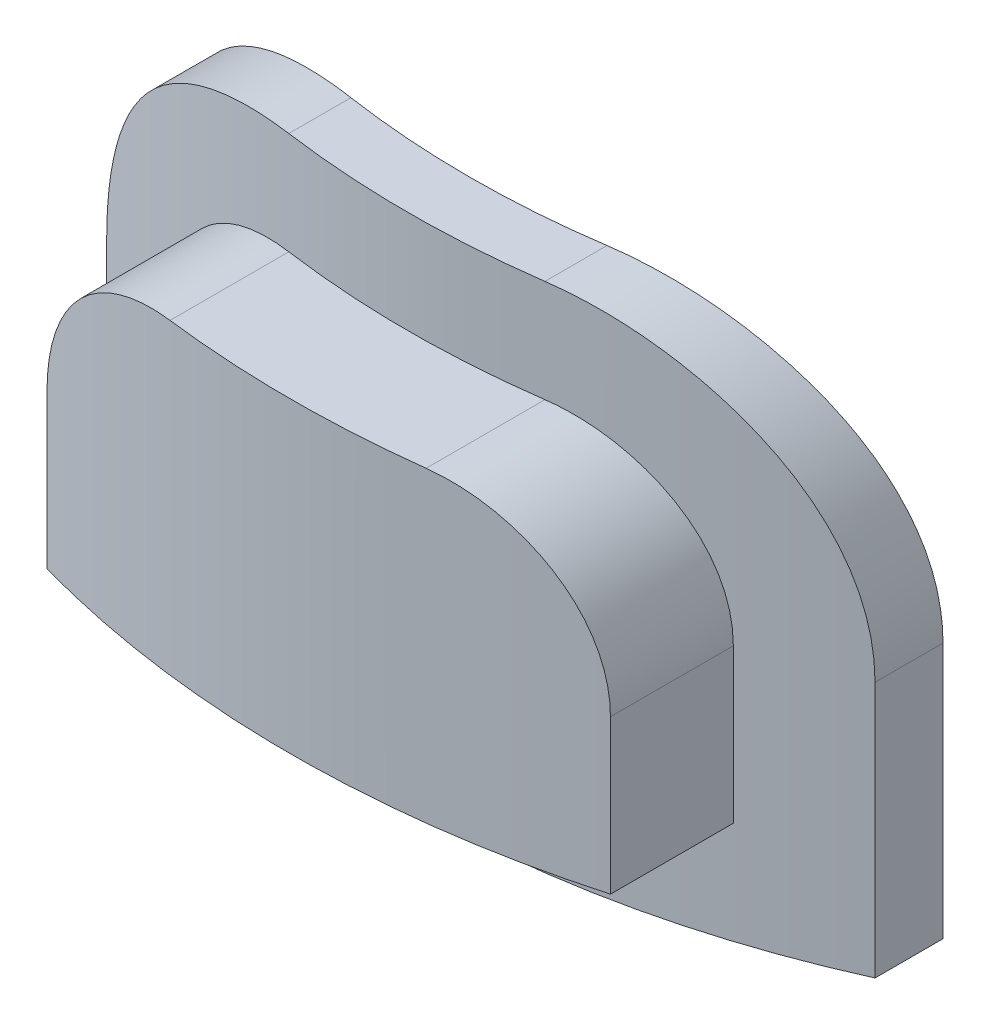
ISO-10303-21;
HEADER;
FILE_DESCRIPTION(('STEP AP214'),'2;1');
FILE_NAME('part.step','',(''),(''),'','','');
FILE_SCHEMA(('AUTOMOTIVE_DESIGN { 1 0 10303 214 1 1 1 1 }'));
ENDSEC;
DATA;
#1=APPLICATION_CONTEXT('core data for automotive mechanical design processes');
#2=APPLICATION_PROTOCOL_DEFINITION('international standard','automotive_design',2000,#1);
#3=PRODUCT_CONTEXT('',#1,'mechanical');
#4=PRODUCT('Part','Part','',(#3));
#5=PRODUCT_RELATED_PRODUCT_CATEGORY('part','',(#4));
#6=PRODUCT_DEFINITION_FORMATION('','',#4);
#7=PRODUCT_DEFINITION_CONTEXT('part definition',#1,'design');
#8=PRODUCT_DEFINITION('design','',#6,#7);
#9=PRODUCT_DEFINITION_SHAPE('','',#8);
#10=(LENGTH_UNIT() NAMED_UNIT(*) SI_UNIT(.MILLI.,.METRE.));
#11=(NAMED_UNIT(*) PLANE_ANGLE_UNIT() SI_UNIT($,.RADIAN.));
#12=(NAMED_UNIT(*) SI_UNIT($,.STERADIAN.) SOLID_ANGLE_UNIT());
#13=UNCERTAINTY_MEASURE_WITH_UNIT(LENGTH_MEASURE(1.E-05),#10,'distance_accuracy_value','');
#14=(GEOMETRIC_REPRESENTATION_CONTEXT(3) GLOBAL_UNCERTAINTY_ASSIGNED_CONTEXT((#13)) GLOBAL_UNIT_ASSIGNED_CONTEXT((#10,
#11,#12)) REPRESENTATION_CONTEXT('',''));
#15=CARTESIAN_POINT('',(0.,0.,0.));
#16=DIRECTION('',(0.,0.,1.));
#17=DIRECTION('',(1.,0.,0.));
#18=AXIS2_PLACEMENT_3D('',#15,#16,#17);
#19=CARTESIAN_POINT('',(0.,5.,0.));
#20=DIRECTION('',(0.,-1.,0.));
#21=DIRECTION('',(0.,0.,-1.));
#22=AXIS2_PLACEMENT_3D('',#19,#20,#21);
#23=CYLINDRICAL_SURFACE('',#22,8.5);
#24=DIRECTION('',(0.,-1.,0.));
#25=VECTOR('',#24,1.);
#26=CARTESIAN_POINT('',(-3.75,5.,7.62807315119618));
#27=LINE('',#26,#25);
#28=CARTESIAN_POINT('',(-3.75,0.,7.62807315119618));
#29=VERTEX_POINT('',#28);
#30=CARTESIAN_POINT('',(-3.75,2.5,7.62807315119618));
#31=VERTEX_POINT('',#30);
#32=EDGE_CURVE('E313',#29,#31,#27,.F.);
#33=ORIENTED_EDGE('',*,*,#32,.T.);
#34=CARTESIAN_POINT('',(-1.25,5.,8.40758586040012));
#35=CARTESIAN_POINT('',(-1.11527633630875,5.0000006675563,8.42761678228659));
#36=CARTESIAN_POINT('',(-0.980067726993901,4.98907881950588,8.44437922509842));
#37=CARTESIAN_POINT('',(-0.712559130804479,4.9453054998278,8.47114661131485));
#38=CARTESIAN_POINT('',(-0.580258873514958,4.9124560759831,8.48115218555762));
#39=CARTESIAN_POINT('',(-0.322493366822613,4.82556034376801,8.49486143334507));
#40=CARTESIAN_POINT('',(-0.197027388328415,4.77151630153589,8.49856578039391));
#41=CARTESIAN_POINT('',(0.0434727015224548,4.64370672720696,8.50074070468024));
#42=CARTESIAN_POINT('',(0.158505406936883,4.56993854244323,8.49921057761536));
#43=CARTESIAN_POINT('',(0.375526788148994,4.40430971028086,8.49239941522909));
#44=CARTESIAN_POINT('',(0.477443871551579,4.31235618280992,8.48709874536711));
#45=CARTESIAN_POINT('',(0.66483338824675,4.11310967805214,8.47448144847077));
#46=CARTESIAN_POINT('',(0.750303952831173,4.00581496005958,8.4671645925801));
#47=CARTESIAN_POINT('',(0.904396462982264,3.7759964917475,8.45211348962479));
#48=CARTESIAN_POINT('',(0.972566968867322,3.65317008622935,8.44437344657907));
#49=CARTESIAN_POINT('',(1.08743529986527,3.39777586849052,8.43035294157353));
#50=CARTESIAN_POINT('',(1.13413309697848,3.26520804356761,8.42407248151697));
#51=CARTESIAN_POINT('',(1.20482622415403,2.99355043280274,8.41425491186282));
#52=CARTESIAN_POINT('',(1.22874219154639,2.85443960643935,8.41072740007635));
#53=CARTESIAN_POINT('',(1.25285608166608,2.57413785983828,8.40716991411397));
#54=CARTESIAN_POINT('',(1.25305560103829,2.43294708026779,8.40713970449176));
#55=CARTESIAN_POINT('',(1.22985510780667,2.15401193834105,8.41056390144703));
#56=CARTESIAN_POINT('',(1.2066943287525,2.01624714761094,8.41398298379495));
#57=CARTESIAN_POINT('',(1.13782686364863,1.74657282641444,8.42357088878668));
#58=CARTESIAN_POINT('',(1.09211891049656,1.61466362547369,8.42973986596675));
#59=CARTESIAN_POINT('',(0.979247569768038,1.35984660550828,8.44359533540404));
#60=CARTESIAN_POINT('',(0.912001819869463,1.23697560424031,8.45128760905227));
#61=CARTESIAN_POINT('',(0.757959921476296,1.00414435560503,8.46649084407854));
#62=CARTESIAN_POINT('',(0.67116228631113,0.894185090977744,8.47400179162094));
#63=CARTESIAN_POINT('',(0.479573594588255,0.689365171798441,8.48700664516004));
#64=CARTESIAN_POINT('',(0.374639866670625,0.594636701022906,8.49248338211674));
#65=CARTESIAN_POINT('',(0.150237260666964,0.424142585904,8.49941186296481));
#66=CARTESIAN_POINT('',(0.030770268844126,0.348374484600208,8.5008641286092));
#67=CARTESIAN_POINT('',(-0.217333908493297,0.219017192052513,8.49811224994414));
#68=CARTESIAN_POINT('',(-0.345810130460131,0.165117799328062,8.49399109418641));
#69=CARTESIAN_POINT('',(-0.609565017242179,0.0794501416514689,8.47914233315239));
#70=CARTESIAN_POINT('',(-0.744842465038015,0.0476779322408202,8.46841590599442));
#71=CARTESIAN_POINT('',(-1.01506885962729,0.00739764887891314,8.4402422574371));
#72=CARTESIAN_POINT('',(-1.14996089360887,-0.00160163790743167,8.42294636908654));
#73=CARTESIAN_POINT('',(-1.41844778814057,0.00206963442643112,8.38191235820854));
#74=CARTESIAN_POINT('',(-1.55204255934868,0.0147416755468378,8.35817379519028));
#75=CARTESIAN_POINT('',(-1.81632932140585,0.061242263397403,8.30478137153844));
#76=CARTESIAN_POINT('',(-1.946950928167,0.0953755450744826,8.27504657176548));
#77=CARTESIAN_POINT('',(-2.20012909232565,0.18370003126403,8.21136381122794));
#78=CARTESIAN_POINT('',(-2.3226834777036,0.237896611815497,8.17741472285042));
#79=CARTESIAN_POINT('',(-2.56343285395966,0.368187062496278,8.10527274068938));
#80=CARTESIAN_POINT('',(-2.6810343141059,0.445306037022554,8.06694965225901));
#81=CARTESIAN_POINT('',(-2.90172237874028,0.618120429739,7.9902240631891));
#82=CARTESIAN_POINT('',(-3.00480301353537,0.713823449829269,7.95182153643648));
#83=CARTESIAN_POINT('',(-3.1975140978759,0.925689139261734,7.8763583260915));
#84=CARTESIAN_POINT('',(-3.28649003745961,1.04248769599738,7.83940299693696));
#85=CARTESIAN_POINT('',(-3.44325901546629,1.2911996884414,7.771826220011));
#86=CARTESIAN_POINT('',(-3.51105916392675,1.42310803047428,7.74120264744268));
#87=CARTESIAN_POINT('',(-3.62014114156516,1.69220879758193,7.69077673586528));
#88=CARTESIAN_POINT('',(-3.66249476048576,1.82888296768165,7.67054323039584));
#89=CARTESIAN_POINT('',(-3.72329966959897,2.10856686614807,7.64121828064005));
#90=CARTESIAN_POINT('',(-3.74177133917026,2.25157108490913,7.63211733687186));
#91=CARTESIAN_POINT('',(-3.75326327270084,2.52524876770563,7.62646912612301));
#92=CARTESIAN_POINT('',(-3.74852353818925,2.65581055825829,7.62881690889369));
#93=CARTESIAN_POINT('',(-3.71889534520874,2.91405752920416,7.64330328511075));
#94=CARTESIAN_POINT('',(-3.69400747645747,3.04174279367825,7.65544159199731));
#95=CARTESIAN_POINT('',(-3.62593698592528,3.28797238865289,7.68790924095043));
#96=CARTESIAN_POINT('',(-3.58316045835813,3.40665446229439,7.70805630123149));
#97=CARTESIAN_POINT('',(-3.48091283816763,3.63521599155453,7.7547658364077));
#98=CARTESIAN_POINT('',(-3.42143722591223,3.74509305372065,7.78133004784219));
#99=CARTESIAN_POINT('',(-3.28240454351572,3.96189837055597,7.84104280541274));
#100=CARTESIAN_POINT('',(-3.20166837603727,4.06797418348805,7.87453750314042));
#101=CARTESIAN_POINT('',(-3.02491780473161,4.26557579392537,7.94411049632042));
#102=CARTESIAN_POINT('',(-2.9288960284365,4.35709452754147,7.98019003383625));
#103=CARTESIAN_POINT('',(-2.71509427055919,4.5307640821006,8.05556538118288));
#104=CARTESIAN_POINT('',(-2.59616879442661,4.61150241344252,8.09487908298208));
#105=CARTESIAN_POINT('',(-2.34563176565117,4.75170856314094,8.17099338750652));
#106=CARTESIAN_POINT('',(-2.21402077490426,4.81117732306902,8.20779410141955));
#107=CARTESIAN_POINT('',(-1.94610216424461,4.90517903242794,8.27533064467517));
#108=CARTESIAN_POINT('',(-1.81011559926145,4.94050506239353,8.30623251518836));
#109=CARTESIAN_POINT('',(-1.5329299970716,4.98790991023623,8.36182214548129));
#110=CARTESIAN_POINT('',(-1.39173335956116,4.99999929771062,8.38651272613186));
#111=CARTESIAN_POINT('',(-1.25,5.,8.40758586040012));
#112=B_SPLINE_CURVE_WITH_KNOTS('',3,(#34,#35,#36,#37,#38,#39,#40,#41,#42,#43,#44,#45,#46,#47,
#48,#49,#50,#51,#52,#53,#54,#55,#56,#57,#58,#59,#60,#61,#62,#63,#64,#65,#66,#67,#68,#69,#70,#71,
#72,#73,#74,#75,#76,#77,#78,#79,#80,#81,#82,#83,#84,#85,#86,#87,#88,#89,#90,#91,#92,#93,#94,#95,
#96,#97,#98,#99,#100,#101,#102,#103,#104,#105,#106,#107,#108,#109,#110,#111),.UNSPECIFIED.,.T.,
.F.,(4,2,2,2,2,2,2,2,2,2,2,2,2,2,2,2,2,2,2,2,2,2,2,2,2,2,2,2,2,2,2,2,2,2,2,2,2,2,4),(0.,
0.408120216394532,0.816202324394259,1.22424081195945,1.63233420356413,2.04256838598693,
2.45284915309353,2.8729343771028,3.29302014888754,3.71456403472322,4.13607954125567,
4.5533216878384,4.97058728519829,5.38946798426441,5.80838054460301,6.23075250542988,
6.6530697052352,7.06916732105481,7.48519074305774,7.89216093809074,8.29915896501436,
8.7120707956948,9.12509334788576,9.56043683136778,9.99595877092002,10.4479189790577,
10.8997272723412,11.3308545134453,11.7616136138744,12.1516698959668,12.5417147618777,
12.9233484355043,13.3050854985832,13.71571162798,14.1265364116648,14.5715345450817,
15.0165129766695,15.4460631943471,15.875417977238),.UNSPECIFIED.);
#113=CARTESIAN_POINT('',(-1.25,5.,8.40758586040012));
#114=VERTEX_POINT('',#113);
#115=EDGE_CURVE('E308',#31,#114,#112,.T.);
#116=ORIENTED_EDGE('',*,*,#115,.T.);
#117=CARTESIAN_POINT('',(0.,5.,0.));
#118=DIRECTION('',(0.,1.,0.));
#119=DIRECTION('',(0.,0.,1.));
#120=AXIS2_PLACEMENT_3D('',#117,#118,#119);
#121=CIRCLE('',#120,8.5);
#122=CARTESIAN_POINT('',(1.25,5.,8.40758586040012));
#123=VERTEX_POINT('',#122);
#124=EDGE_CURVE('E341',#114,#123,#121,.T.);
#125=ORIENTED_EDGE('',*,*,#124,.T.);
#126=CARTESIAN_POINT('',(1.25,5.,8.40758586040012));
#127=CARTESIAN_POINT('',(1.32109498409677,5.0000078043449,8.397024564467));
#128=CARTESIAN_POINT('',(1.39204227683481,4.99696760173464,8.38554623136623));
#129=CARTESIAN_POINT('',(1.53310748251208,4.98492437728934,8.36090112066793));
#130=CARTESIAN_POINT('',(1.60322568911255,4.97592353527694,8.34773496173197));
#131=CARTESIAN_POINT('',(1.74194811862711,4.95212691793934,8.31989270968634));
#132=CARTESIAN_POINT('',(1.81055617228141,4.93734818168633,8.30522114900417));
#133=CARTESIAN_POINT('',(1.94599670313446,4.90218432385241,8.2745348955105));
#134=CARTESIAN_POINT('',(2.01282905335053,4.88179880250055,8.25852010698175));
#135=CARTESIAN_POINT('',(2.20987826013263,4.81256726064929,8.2088184502288));
#136=CARTESIAN_POINT('',(2.33691398060633,4.75559967071488,8.17341983953064));
#137=CARTESIAN_POINT('',(2.57931012291404,4.62182664632304,8.10020116817731));
#138=CARTESIAN_POINT('',(2.69466136400265,4.545005778455,8.06237924098058));
#139=CARTESIAN_POINT('',(2.91563592547765,4.36984826471379,7.98519334402301));
#140=CARTESIAN_POINT('',(3.02066213603807,4.27075515897463,7.94583008496088));
#141=CARTESIAN_POINT('',(3.21262713455137,4.05528621504434,7.870177783025));
#142=CARTESIAN_POINT('',(3.29956220570281,3.93890683381021,7.83388937278106));
#143=CARTESIAN_POINT('',(3.45257191055821,3.69155994264599,7.76767096131929));
#144=CARTESIAN_POINT('',(3.51865692848634,3.56059973870235,7.73773779735249));
#145=CARTESIAN_POINT('',(3.62720528824781,3.28763308795972,7.68745759818812));
#146=CARTESIAN_POINT('',(3.66971445829755,3.1456486878365,7.66709197687445));
#147=CARTESIAN_POINT('',(3.71614939701319,2.91850850837562,7.64464325473185));
#148=CARTESIAN_POINT('',(3.72881394055898,2.83545002134511,7.63846137081106));
#149=CARTESIAN_POINT('',(3.74574676163379,2.66828187225346,7.63016470710817));
#150=CARTESIAN_POINT('',(3.75001489677904,2.58417219239083,7.62804999629597));
#151=CARTESIAN_POINT('',(3.75,2.5,7.62807315119618));
#152=B_SPLINE_CURVE_WITH_KNOTS('',3,(#126,#127,#128,#129,#130,#131,#132,#133,#134,#135,#136,
#137,#138,#139,#140,#141,#142,#143,#144,#145,#146,#147,#148,#149,#150,#151),.UNSPECIFIED.,.F.,
.F.,(4,2,2,2,2,2,2,2,2,2,2,2,4),(0.,0.215537630848035,0.430996482472698,0.645824679066829,
0.860668197158763,1.28953695550444,1.71874011315056,2.16563799169668,2.61262759439177,
3.0593942243094,3.5052893297048,3.75754987330671,4.00981469463004),.UNSPECIFIED.);
#153=CARTESIAN_POINT('',(3.75,2.5,7.62807315119618));
#154=VERTEX_POINT('',#153);
#155=EDGE_CURVE('E301',#123,#154,#152,.T.);
#156=ORIENTED_EDGE('',*,*,#155,.T.);
#157=DIRECTION('',(0.,-1.,0.));
#158=VECTOR('',#157,1.);
#159=CARTESIAN_POINT('',(3.75,5.,7.62807315119618));
#160=LINE('',#159,#158);
#161=CARTESIAN_POINT('',(3.75,0.,7.62807315119618));
#162=VERTEX_POINT('',#161);
#163=EDGE_CURVE('E332',#162,#154,#160,.F.);
#164=ORIENTED_EDGE('',*,*,#163,.F.);
#165=CARTESIAN_POINT('',(0.,0.,0.));
#166=DIRECTION('',(0.,1.,0.));
#167=DIRECTION('',(0.,0.,1.));
#168=AXIS2_PLACEMENT_3D('',#165,#166,#167);
#169=CIRCLE('',#168,8.5);
#170=EDGE_CURVE('E344',#29,#162,#169,.T.);
#171=ORIENTED_EDGE('',*,*,#170,.F.);
#172=EDGE_LOOP('',(#33,#116,#125,#156,#164,#171));
#173=FACE_BOUND('',#172,.T.);
#174=CARTESIAN_POINT('',(0.,1.5,0.));
#175=DIRECTION('',(0.,1.,0.));
#176=DIRECTION('',(-1.,0.,0.));
#177=AXIS2_PLACEMENT_3D('',#174,#175,#176);
#178=CIRCLE('',#177,8.5);
#179=CARTESIAN_POINT('',(-1.5,1.5,8.36660026534076));
#180=VERTEX_POINT('',#179);
#181=CARTESIAN_POINT('',(1.5,1.5,8.36660026534076));
#182=VERTEX_POINT('',#181);
#183=EDGE_CURVE('E262',#180,#182,#178,.T.);
#184=ORIENTED_EDGE('',*,*,#183,.T.);
#185=DIRECTION('',(0.,-1.,0.));
#186=VECTOR('',#185,1.);
#187=CARTESIAN_POINT('',(1.5,5.,8.36660026534076));
#188=LINE('',#187,#186);
#189=CARTESIAN_POINT('',(1.5,3.3,8.36660026534076));
#190=VERTEX_POINT('',#189);
#191=EDGE_CURVE('E12',#182,#190,#188,.F.);
#192=ORIENTED_EDGE('',*,*,#191,.T.);
#193=CARTESIAN_POINT('',(0.,3.3,0.));
#194=DIRECTION('',(0.,-1.,0.));
#195=DIRECTION('',(1.,0.,0.));
#196=AXIS2_PLACEMENT_3D('',#193,#194,#195);
#197=CIRCLE('',#196,8.5);
#198=CARTESIAN_POINT('',(-1.5,3.3,8.36660026534076));
#199=VERTEX_POINT('',#198);
#200=EDGE_CURVE('E44',#190,#199,#197,.T.);
#201=ORIENTED_EDGE('',*,*,#200,.T.);
#202=DIRECTION('',(0.,-1.,0.));
#203=VECTOR('',#202,1.);
#204=CARTESIAN_POINT('',(-1.5,5.,8.36660026534076));
#205=LINE('',#204,#203);
#206=EDGE_CURVE('E543',#199,#180,#205,.T.);
#207=ORIENTED_EDGE('',*,*,#206,.T.);
#208=EDGE_LOOP('',(#184,#192,#201,#207));
#209=FACE_BOUND('',#208,.T.);
#210=ADVANCED_FACE('F35',(#173,#209),#23,.F.);
#211=CARTESIAN_POINT('',(0.,0.,0.));
#212=DIRECTION('',(0.,1.,0.));
#213=DIRECTION('',(0.,0.,1.));
#214=AXIS2_PLACEMENT_3D('',#211,#212,#213);
#215=PLANE('',#214);
#216=DIRECTION('',(0.,0.,1.));
#217=VECTOR('',#216,1.);
#218=CARTESIAN_POINT('',(3.75,0.,-10.25));
#219=LINE('',#218,#217);
#220=CARTESIAN_POINT('',(3.75,0.,8.29141121884568));
#221=VERTEX_POINT('',#220);
#222=EDGE_CURVE('E335',#162,#221,#219,.T.);
#223=ORIENTED_EDGE('',*,*,#222,.T.);
#224=CARTESIAN_POINT('',(0.,0.,0.));
#225=DIRECTION('',(0.,-1.,0.));
#226=DIRECTION('',(0.,0.,-1.));
#227=AXIS2_PLACEMENT_3D('',#224,#225,#226);
#228=CIRCLE('',#227,9.1);
#229=CARTESIAN_POINT('',(-3.75,0.,8.29141121884568));
#230=VERTEX_POINT('',#229);
#231=EDGE_CURVE('E170',#230,#221,#228,.F.);
#232=ORIENTED_EDGE('',*,*,#231,.F.);
#233=DIRECTION('',(0.,0.,1.));
#234=VECTOR('',#233,1.);
#235=CARTESIAN_POINT('',(-3.75,0.,-10.25));
#236=LINE('',#235,#234);
#237=EDGE_CURVE('E354',#29,#230,#236,.T.);
#238=ORIENTED_EDGE('',*,*,#237,.F.);
#239=ORIENTED_EDGE('',*,*,#170,.T.);
#240=EDGE_LOOP('',(#223,#232,#238,#239));
#241=FACE_BOUND('',#240,.T.);
#242=ADVANCED_FACE('F283',(#241),#215,.F.);
#243=CARTESIAN_POINT('',(0.,5.,0.));
#244=DIRECTION('',(0.,1.,0.));
#245=DIRECTION('',(0.,0.,1.));
#246=AXIS2_PLACEMENT_3D('',#243,#244,#245);
#247=PLANE('',#246);
#248=CARTESIAN_POINT('',(0.,5.,0.));
#249=DIRECTION('',(0.,-1.,0.));
#250=DIRECTION('',(0.,0.,-1.));
#251=AXIS2_PLACEMENT_3D('',#248,#249,#250);
#252=CIRCLE('',#251,9.1);
#253=CARTESIAN_POINT('',(-1.25,5.,9.01373951254417));
#254=VERTEX_POINT('',#253);
#255=CARTESIAN_POINT('',(1.25,5.,9.01373951254417));
#256=VERTEX_POINT('',#255);
#257=EDGE_CURVE('E226',#254,#256,#252,.F.);
#258=ORIENTED_EDGE('',*,*,#257,.T.);
#259=DIRECTION('',(0.,0.,1.));
#260=VECTOR('',#259,1.);
#261=CARTESIAN_POINT('',(1.25,5.,-10.25));
#262=LINE('',#261,#260);
#263=EDGE_CURVE('E337',#123,#256,#262,.T.);
#264=ORIENTED_EDGE('',*,*,#263,.F.);
#265=ORIENTED_EDGE('',*,*,#124,.F.);
#266=DIRECTION('',(0.,0.,1.));
#267=VECTOR('',#266,1.);
#268=CARTESIAN_POINT('',(-1.25,5.,-10.25));
#269=LINE('',#268,#267);
#270=EDGE_CURVE('E357',#114,#254,#269,.T.);
#271=ORIENTED_EDGE('',*,*,#270,.T.);
#272=EDGE_LOOP('',(#258,#264,#265,#271));
#273=FACE_BOUND('',#272,.T.);
#274=ADVANCED_FACE('F289',(#273),#247,.T.);
#275=CARTESIAN_POINT('',(3.75,0.,-10.25));
#276=DIRECTION('',(-1.,0.,0.));
#277=DIRECTION('',(0.,-1.,0.));
#278=AXIS2_PLACEMENT_3D('',#275,#276,#277);
#279=PLANE('',#278);
#280=DIRECTION('',(0.,0.,1.));
#281=VECTOR('',#280,1.);
#282=CARTESIAN_POINT('',(3.75,2.5,-10.25));
#283=LINE('',#282,#281);
#284=CARTESIAN_POINT('',(3.75,2.5,8.29141121884568));
#285=VERTEX_POINT('',#284);
#286=EDGE_CURVE('E222',#154,#285,#283,.T.);
#287=ORIENTED_EDGE('',*,*,#286,.T.);
#288=DIRECTION('',(0.,-1.,0.));
#289=VECTOR('',#288,1.);
#290=CARTESIAN_POINT('',(3.75,5.,8.29141121884568));
#291=LINE('',#290,#289);
#292=EDGE_CURVE('E329',#285,#221,#291,.T.);
#293=ORIENTED_EDGE('',*,*,#292,.T.);
#294=ORIENTED_EDGE('',*,*,#222,.F.);
#295=ORIENTED_EDGE('',*,*,#163,.T.);
#296=EDGE_LOOP('',(#287,#293,#294,#295));
#297=FACE_BOUND('',#296,.T.);
#298=ADVANCED_FACE('F317',(#297),#279,.F.);
#299=CARTESIAN_POINT('',(1.25,2.5,-10.25));
#300=DIRECTION('',(0.,0.,1.));
#301=DIRECTION('',(1.,0.,0.));
#302=AXIS2_PLACEMENT_3D('',#299,#300,#301);
#303=CYLINDRICAL_SURFACE('',#302,2.5);
#304=CARTESIAN_POINT('',(3.75,2.5,8.29141121884568));
#305=CARTESIAN_POINT('',(3.75001002585667,2.56668328002895,8.29140028132558));
#306=CARTESIAN_POINT('',(3.74733226391829,2.63335963596565,8.29261761935478));
#307=CARTESIAN_POINT('',(3.73667905745048,2.76617904564726,8.29742682159189));
#308=CARTESIAN_POINT('',(3.72870545351762,2.83232227660139,8.30101786080594));
#309=CARTESIAN_POINT('',(3.70757960177401,2.96334719349341,8.31047408412195));
#310=CARTESIAN_POINT('',(3.69444765669241,3.02823279124661,8.31633035114265));
#311=CARTESIAN_POINT('',(3.6631574010249,3.15653431830028,8.33016020450381));
#312=CARTESIAN_POINT('',(3.64499883103864,3.2199501715711,8.33813390011388));
#313=CARTESIAN_POINT('',(3.58327295763412,3.40722895021895,8.36493795981294));
#314=CARTESIAN_POINT('',(3.53241582628127,3.52836510849129,8.38666981404831));
#315=CARTESIAN_POINT('',(3.41303636201255,3.76029277800592,8.43595465002086));
#316=CARTESIAN_POINT('',(3.34449885498615,3.87107529146149,8.46351262832077));
#317=CARTESIAN_POINT('',(3.18784753257445,4.08531157286444,8.5237904525393));
#318=CARTESIAN_POINT('',(3.09892646983261,4.18812227169586,8.55669945447047));
#319=CARTESIAN_POINT('',(2.90595457400091,4.37780101411043,8.62414463720136));
#320=CARTESIAN_POINT('',(2.80189784049669,4.46466281023979,8.65868144901273));
#321=CARTESIAN_POINT('',(2.57381390647128,4.62561316810556,8.72929647312018));
#322=CARTESIAN_POINT('',(2.44893023067962,4.69851177551892,8.76532985021694));
#323=CARTESIAN_POINT('',(2.18779151322515,4.82193291913908,8.8341250155944));
#324=CARTESIAN_POINT('',(2.05154573985379,4.87247348511016,8.86688942343183));
#325=CARTESIAN_POINT('',(1.80448592216433,4.9402554030829,8.91996484884727));
#326=CARTESIAN_POINT('',(1.69527364977672,4.96254416978487,8.94138883027841));
#327=CARTESIAN_POINT('',(1.47417384222457,4.99243717311587,8.98051404728974));
#328=CARTESIAN_POINT('',(1.36228540078739,5.00003636181393,8.99821400128267));
#329=CARTESIAN_POINT('',(1.25,5.,9.01373951254417));
#330=B_SPLINE_CURVE_WITH_KNOTS('',3,(#304,#305,#306,#307,#308,#309,#310,#311,#312,#313,#314,
#315,#316,#317,#318,#319,#320,#321,#322,#323,#324,#325,#326,#327,#328,#329),.UNSPECIFIED.,.F.,
.F.,(4,2,2,2,2,2,2,2,2,2,2,2,4),(0.,0.19997341207444,0.399877358726516,0.599002262078049,
0.798137443240494,1.19567928559974,1.59356345837899,2.01133482591711,2.42926949402788,
2.87424305162385,3.3188571207313,3.65836735401477,3.99799423597027),.UNSPECIFIED.);
#331=EDGE_CURVE('E167',#285,#256,#330,.T.);
#332=ORIENTED_EDGE('',*,*,#331,.F.);
#333=ORIENTED_EDGE('',*,*,#286,.F.);
#334=ORIENTED_EDGE('',*,*,#155,.F.);
#335=ORIENTED_EDGE('',*,*,#263,.T.);
#336=EDGE_LOOP('',(#332,#333,#334,#335));
#337=FACE_BOUND('',#336,.T.);
#338=ADVANCED_FACE('F296',(#337),#303,.T.);
#339=CARTESIAN_POINT('',(-3.75,0.,-10.25));
#340=DIRECTION('',(-1.,0.,0.));
#341=DIRECTION('',(0.,-1.,0.));
#342=AXIS2_PLACEMENT_3D('',#339,#340,#341);
#343=PLANE('',#342);
#344=DIRECTION('',(0.,-1.,0.));
#345=VECTOR('',#344,1.);
#346=CARTESIAN_POINT('',(-3.75,5.,8.29141121884568));
#347=LINE('',#346,#345);
#348=CARTESIAN_POINT('',(-3.75,2.5,8.29141121884568));
#349=VERTEX_POINT('',#348);
#350=EDGE_CURVE('E189',#349,#230,#347,.T.);
#351=ORIENTED_EDGE('',*,*,#350,.F.);
#352=DIRECTION('',(0.,0.,1.));
#353=VECTOR('',#352,1.);
#354=CARTESIAN_POINT('',(-3.75,2.5,-10.25));
#355=LINE('',#354,#353);
#356=EDGE_CURVE('E346',#31,#349,#355,.T.);
#357=ORIENTED_EDGE('',*,*,#356,.F.);
#358=ORIENTED_EDGE('',*,*,#32,.F.);
#359=ORIENTED_EDGE('',*,*,#237,.T.);
#360=EDGE_LOOP('',(#351,#357,#358,#359));
#361=FACE_BOUND('',#360,.T.);
#362=ADVANCED_FACE('F201',(#361),#343,.T.);
#363=CARTESIAN_POINT('',(-1.25,2.5,-10.25));
#364=DIRECTION('',(0.,0.,1.));
#365=DIRECTION('',(1.,0.,0.));
#366=AXIS2_PLACEMENT_3D('',#363,#364,#365);
#367=CYLINDRICAL_SURFACE('',#366,2.5);
#368=CARTESIAN_POINT('',(-1.25,5.,9.01373951254417));
#369=CARTESIAN_POINT('',(-1.32101124740736,5.00000767112239,9.00390003664837));
#370=CARTESIAN_POINT('',(-1.3918938567813,4.99697470601398,8.99320700751757));
#371=CARTESIAN_POINT('',(-1.53287235118059,4.98494998991493,8.97024874727763));
#372=CARTESIAN_POINT('',(-1.60296848451393,4.97596017673178,8.95798402849718));
#373=CARTESIAN_POINT('',(-1.74170768195296,4.95217559681137,8.93204507532227));
#374=CARTESIAN_POINT('',(-1.81035409915526,4.93739624773325,8.91837465506818));
#375=CARTESIAN_POINT('',(-1.94590676296099,4.9022120677279,8.88978370948395));
#376=CARTESIAN_POINT('',(-2.01281290358917,4.88180689508614,8.87486310825571));
#377=CARTESIAN_POINT('',(-2.21015274608582,4.81246600011729,8.82855563638446));
#378=CARTESIAN_POINT('',(-2.33744865323303,4.75536293501446,8.79557730294177));
#379=CARTESIAN_POINT('',(-2.58037489087526,4.621180149911,8.72740793693066));
#380=CARTESIAN_POINT('',(-2.69599742080382,4.54408719311157,8.69221544994507));
#381=CARTESIAN_POINT('',(-2.91682573414429,4.36875772402363,8.6206766294969));
#382=CARTESIAN_POINT('',(-3.02151499446997,4.26986691826992,8.58433375920132));
#383=CARTESIAN_POINT('',(-3.21283716249547,4.05498104327679,8.51458004233961));
#384=CARTESIAN_POINT('',(-3.29946692963101,3.93898300505083,8.48116970632808));
#385=CARTESIAN_POINT('',(-3.45185518588814,3.69279592007848,8.42029915436359));
#386=CARTESIAN_POINT('',(-3.51764360175908,3.56262758536556,8.39283042482878));
#387=CARTESIAN_POINT('',(-3.6258433677077,3.29156469375932,8.34666161548046));
#388=CARTESIAN_POINT('',(-3.66829459326271,3.15068890424058,8.32794658672668));
#389=CARTESIAN_POINT('',(-3.71529798732226,2.9237128395815,8.30703955845716));
#390=CARTESIAN_POINT('',(-3.72828435953488,2.83960642196457,8.30120744723347));
#391=CARTESIAN_POINT('',(-3.74564177537422,2.6703531836863,8.29338288079254));
#392=CARTESIAN_POINT('',(-3.75001465936463,2.58520658918267,8.29138960536909));
#393=CARTESIAN_POINT('',(-3.75,2.5,8.29141121884568));
#394=B_SPLINE_CURVE_WITH_KNOTS('',3,(#368,#369,#370,#371,#372,#373,#374,#375,#376,#377,#378,
#379,#380,#381,#382,#383,#384,#385,#386,#387,#388,#389,#390,#391,#392,#393),.UNSPECIFIED.,.F.,
.F.,(4,2,2,2,2,2,2,2,2,2,2,2,4),(0.,0.214983749604198,0.429897597689074,0.644242974261521,
0.858601373118001,1.28658140123102,1.71484555381219,2.15833642039304,2.60190434627071,
3.04483242131611,3.48700130884952,3.74242746538431,3.99779904147261),.UNSPECIFIED.);
#395=EDGE_CURVE('E181',#254,#349,#394,.T.);
#396=ORIENTED_EDGE('',*,*,#395,.F.);
#397=ORIENTED_EDGE('',*,*,#270,.F.);
#398=ORIENTED_EDGE('',*,*,#115,.F.);
#399=ORIENTED_EDGE('',*,*,#356,.T.);
#400=EDGE_LOOP('',(#396,#397,#398,#399));
#401=FACE_BOUND('',#400,.T.);
#402=ADVANCED_FACE('F269',(#401),#367,.T.);
#403=CARTESIAN_POINT('',(-1.25,2.5,6.26057374902612));
#404=DIRECTION('',(0.,0.,1.));
#405=DIRECTION('',(1.,0.,0.));
#406=AXIS2_PLACEMENT_3D('',#403,#404,#405);
#407=CYLINDRICAL_SURFACE('',#406,1.5);
#408=CARTESIAN_POINT('',(-2.75,2.5,9.87420882906575));
#409=CARTESIAN_POINT('',(-2.7500005767303,2.54125651897526,9.87420712417281));
#410=CARTESIAN_POINT('',(-2.74829679088054,2.5824926549046,9.87468334290739));
#411=CARTESIAN_POINT('',(-2.74150536298313,2.66465725992845,9.87657161255729));
#412=CARTESIAN_POINT('',(-2.73641825667773,2.70558577669634,9.87798351530873));
#413=CARTESIAN_POINT('',(-2.7161581332523,2.82729083830642,9.88358199720229));
#414=CARTESIAN_POINT('',(-2.69598596866482,2.90723195012714,9.88913158962226));
#415=CARTESIAN_POINT('',(-2.6429833586683,3.06243456856704,9.90342778309972));
#416=CARTESIAN_POINT('',(-2.61015347265053,3.1376962818154,9.91217424287501));
#417=CARTESIAN_POINT('',(-2.53285585488331,3.28163514312502,9.93220670121541));
#418=CARTESIAN_POINT('',(-2.48838525314867,3.35031066166554,9.94349332595458));
#419=CARTESIAN_POINT('',(-2.3880760031691,3.48065484467193,9.96806428225641));
#420=CARTESIAN_POINT('',(-2.33202534197718,3.54215341229658,9.98138444652483));
#421=CARTESIAN_POINT('',(-2.21066418289851,3.65498552408141,10.0089625210196));
#422=CARTESIAN_POINT('',(-2.14535101630446,3.70631612840264,10.0232207008695));
#423=CARTESIAN_POINT('',(-2.00521691778894,3.79880483000746,10.0522068023356));
#424=CARTESIAN_POINT('',(-1.9301793916387,3.83963431054933,10.0669366080802));
#425=CARTESIAN_POINT('',(-1.77416223307095,3.90801218429246,10.0955992731535));
#426=CARTESIAN_POINT('',(-1.69318613808403,3.93556841111917,10.1095325982599));
#427=CARTESIAN_POINT('',(-1.55158986132622,3.97061759945708,10.1320587193628));
#428=CARTESIAN_POINT('',(-1.49187291091381,3.98161086977195,10.1410288513174));
#429=CARTESIAN_POINT('',(-1.37147080359788,3.99630473255609,10.1580170053937));
#430=CARTESIAN_POINT('',(-1.31078654094939,4.00001170687878,10.1660358549252));
#431=CARTESIAN_POINT('',(-1.25,4.,10.1734949746879));
#432=B_SPLINE_CURVE_WITH_KNOTS('',3,(#408,#409,#410,#411,#412,#413,#414,#415,#416,#417,#418,
#419,#420,#421,#422,#423,#424,#425,#426,#427,#428,#429,#430,#431),.UNSPECIFIED.,.F.,.F.,(4,2,2,
2,2,2,2,2,2,2,2,4),(0.,0.123691505002667,0.247363428356568,0.493981698841425,0.74058907160692,
0.987257302075676,1.23892174333978,1.49065884187746,1.74951287383133,2.00821394723414,
2.19192714474879,2.37547936142121),.UNSPECIFIED.);
#433=CARTESIAN_POINT('',(-2.75,2.5,9.87420882906575));
#434=VERTEX_POINT('',#433);
#435=CARTESIAN_POINT('',(-1.25,4.,10.1734949746879));
#436=VERTEX_POINT('',#435);
#437=EDGE_CURVE('E256',#434,#436,#432,.T.);
#438=ORIENTED_EDGE('',*,*,#437,.T.);
#439=DIRECTION('',(0.,0.,1.));
#440=VECTOR('',#439,1.);
#441=CARTESIAN_POINT('',(-1.25,4.,6.26057374902612));
#442=LINE('',#441,#440);
#443=CARTESIAN_POINT('',(-1.25,4.,9.01373951254417));
#444=VERTEX_POINT('',#443);
#445=EDGE_CURVE('E59',#444,#436,#442,.T.);
#446=ORIENTED_EDGE('',*,*,#445,.F.);
#447=CARTESIAN_POINT('',(-1.25,4.,9.01373951254417));
#448=CARTESIAN_POINT('',(-1.29280186798228,3.99999985255199,9.00780562822036));
#449=CARTESIAN_POINT('',(-1.3355385686218,3.99816700022005,9.00156615870756));
#450=CARTESIAN_POINT('',(-1.42060903496499,3.99087773090836,8.98853251775688));
#451=CARTESIAN_POINT('',(-1.46294287060377,3.9854219549321,8.98173844463142));
#452=CARTESIAN_POINT('',(-1.5887617534816,3.96371518273507,8.96063791985365));
#453=CARTESIAN_POINT('',(-1.67126253057021,3.94212432398702,8.94558548715095));
#454=CARTESIAN_POINT('',(-1.83116435270777,3.88544359578352,8.91422990725478));
#455=CARTESIAN_POINT('',(-1.90856603259853,3.85035541049064,8.89792691630594));
#456=CARTESIAN_POINT('',(-2.05631953648958,3.76768016399124,8.86494679397568));
#457=CARTESIAN_POINT('',(-2.12667006480461,3.72009081142723,8.84826959451808));
#458=CARTESIAN_POINT('',(-2.25932875642939,3.61293507375529,8.8153374944311));
#459=CARTESIAN_POINT('',(-2.32151600231345,3.55321618394994,8.79909129251164));
#460=CARTESIAN_POINT('',(-2.43495330566396,3.42373759939863,8.76837863720125));
#461=CARTESIAN_POINT('',(-2.48620218083867,3.35397682062177,8.75391237626966));
#462=CARTESIAN_POINT('',(-2.57563591696219,3.20710819362846,8.72801529650637));
#463=CARTESIAN_POINT('',(-2.61395962894763,3.13009060863035,8.7165525314131));
#464=CARTESIAN_POINT('',(-2.67695859451067,2.97026183929524,8.6974126783368));
#465=CARTESIAN_POINT('',(-2.70164947198586,2.88745741014246,8.68973125784702));
#466=CARTESIAN_POINT('',(-2.72933639864841,2.75329075325758,8.6810618607741));
#467=CARTESIAN_POINT('',(-2.73707665827934,2.70295331423107,8.67862085513027));
#468=CARTESIAN_POINT('',(-2.74740887291912,2.60175328459744,8.67535328617443));
#469=CARTESIAN_POINT('',(-2.75000604624903,2.55089127897172,8.67452508647801));
#470=CARTESIAN_POINT('',(-2.75,2.5,8.67453168764747));
#471=B_SPLINE_CURVE_WITH_KNOTS('',3,(#447,#448,#449,#450,#451,#452,#453,#454,#455,#456,#457,
#458,#459,#460,#461,#462,#463,#464,#465,#466,#467,#468,#469,#470),.UNSPECIFIED.,.F.,.F.,(4,2,2,
2,2,2,2,2,2,2,2,4),(0.,0.129550046598253,0.259077178025627,0.517538397283225,0.775967376853487,
1.03444375734575,1.29639719228907,1.55837892657668,1.81744926181568,2.07622207017151,
2.22892169125699,2.38146629943573),.UNSPECIFIED.);
#472=CARTESIAN_POINT('',(-2.75,2.5,8.67453168764747));
#473=VERTEX_POINT('',#472);
#474=EDGE_CURVE('E207',#444,#473,#471,.T.);
#475=ORIENTED_EDGE('',*,*,#474,.T.);
#476=DIRECTION('',(0.,0.,1.));
#477=VECTOR('',#476,1.);
#478=CARTESIAN_POINT('',(-2.75,2.5,6.26057374902612));
#479=LINE('',#478,#477);
#480=EDGE_CURVE('E397',#473,#434,#479,.T.);
#481=ORIENTED_EDGE('',*,*,#480,.T.);
#482=EDGE_LOOP('',(#438,#446,#475,#481));
#483=FACE_BOUND('',#482,.T.);
#484=ADVANCED_FACE('F264',(#483),#407,.T.);
#485=CARTESIAN_POINT('',(-2.75,0.,6.26057374902612));
#486=DIRECTION('',(-1.,0.,0.));
#487=DIRECTION('',(0.,0.,1.));
#488=AXIS2_PLACEMENT_3D('',#485,#486,#487);
#489=PLANE('',#488);
#490=DIRECTION('',(0.,-1.,0.));
#491=VECTOR('',#490,1.);
#492=CARTESIAN_POINT('',(-2.75,5.,9.87420882906575));
#493=LINE('',#492,#491);
#494=CARTESIAN_POINT('',(-2.75,1.,9.87420882906575));
#495=VERTEX_POINT('',#494);
#496=EDGE_CURVE('E254',#495,#434,#493,.F.);
#497=ORIENTED_EDGE('',*,*,#496,.T.);
#498=ORIENTED_EDGE('',*,*,#480,.F.);
#499=DIRECTION('',(0.,-1.,0.));
#500=VECTOR('',#499,1.);
#501=CARTESIAN_POINT('',(-2.75,5.,8.67453168764747));
#502=LINE('',#501,#500);
#503=CARTESIAN_POINT('',(-2.75,1.,8.67453168764747));
#504=VERTEX_POINT('',#503);
#505=EDGE_CURVE('E223',#473,#504,#502,.T.);
#506=ORIENTED_EDGE('',*,*,#505,.T.);
#507=DIRECTION('',(0.,0.,1.));
#508=VECTOR('',#507,1.);
#509=CARTESIAN_POINT('',(-2.75,1.,6.26057374902612));
#510=LINE('',#509,#508);
#511=EDGE_CURVE('E395',#504,#495,#510,.T.);
#512=ORIENTED_EDGE('',*,*,#511,.T.);
#513=EDGE_LOOP('',(#497,#498,#506,#512));
#514=FACE_BOUND('',#513,.T.);
#515=ADVANCED_FACE('F268',(#514),#489,.T.);
#516=CARTESIAN_POINT('',(0.,1.,6.26057374902612));
#517=DIRECTION('',(0.,1.,0.));
#518=DIRECTION('',(0.,0.,1.));
#519=AXIS2_PLACEMENT_3D('',#516,#517,#518);
#520=PLANE('',#519);
#521=ORIENTED_EDGE('',*,*,#511,.F.);
#522=CARTESIAN_POINT('',(0.,1.,0.));
#523=DIRECTION('',(0.,1.,0.));
#524=DIRECTION('',(0.,0.,1.));
#525=AXIS2_PLACEMENT_3D('',#522,#523,#524);
#526=CIRCLE('',#525,9.1);
#527=CARTESIAN_POINT('',(2.75,0.999999999999999,8.67453168764747));
#528=VERTEX_POINT('',#527);
#529=EDGE_CURVE('E392',#528,#504,#526,.F.);
#530=ORIENTED_EDGE('',*,*,#529,.F.);
#531=DIRECTION('',(0.,0.,1.));
#532=VECTOR('',#531,1.);
#533=CARTESIAN_POINT('',(2.75,1.,6.26057374902612));
#534=LINE('',#533,#532);
#535=CARTESIAN_POINT('',(2.75,1.,9.87420882906575));
#536=VERTEX_POINT('',#535);
#537=EDGE_CURVE('E389',#528,#536,#534,.T.);
#538=ORIENTED_EDGE('',*,*,#537,.T.);
#539=CARTESIAN_POINT('',(0.,1.,0.));
#540=DIRECTION('',(0.,1.,0.));
#541=DIRECTION('',(0.,0.,1.));
#542=AXIS2_PLACEMENT_3D('',#539,#540,#541);
#543=CIRCLE('',#542,10.25);
#544=EDGE_CURVE('E251',#495,#536,#543,.T.);
#545=ORIENTED_EDGE('',*,*,#544,.F.);
#546=EDGE_LOOP('',(#521,#530,#538,#545));
#547=FACE_BOUND('',#546,.T.);
#548=ADVANCED_FACE('F273',(#547),#520,.F.);
#549=CARTESIAN_POINT('',(2.75,0.,6.26057374902612));
#550=DIRECTION('',(-1.,0.,0.));
#551=DIRECTION('',(0.,0.,1.));
#552=AXIS2_PLACEMENT_3D('',#549,#550,#551);
#553=PLANE('',#552);
#554=ORIENTED_EDGE('',*,*,#537,.F.);
#555=DIRECTION('',(0.,-1.,0.));
#556=VECTOR('',#555,1.);
#557=CARTESIAN_POINT('',(2.75,5.,8.67453168764747));
#558=LINE('',#557,#556);
#559=CARTESIAN_POINT('',(2.75,2.5,8.67453168764747));
#560=VERTEX_POINT('',#559);
#561=EDGE_CURVE('E224',#560,#528,#558,.T.);
#562=ORIENTED_EDGE('',*,*,#561,.F.);
#563=DIRECTION('',(0.,0.,1.));
#564=VECTOR('',#563,1.);
#565=CARTESIAN_POINT('',(2.75,2.5,6.26057374902612));
#566=LINE('',#565,#564);
#567=CARTESIAN_POINT('',(2.75,2.5,9.87420882906575));
#568=VERTEX_POINT('',#567);
#569=EDGE_CURVE('E180',#560,#568,#566,.T.);
#570=ORIENTED_EDGE('',*,*,#569,.T.);
#571=DIRECTION('',(0.,-1.,0.));
#572=VECTOR('',#571,1.);
#573=CARTESIAN_POINT('',(2.75,5.,9.87420882906575));
#574=LINE('',#573,#572);
#575=EDGE_CURVE('E246',#536,#568,#574,.F.);
#576=ORIENTED_EDGE('',*,*,#575,.F.);
#577=EDGE_LOOP('',(#554,#562,#570,#576));
#578=FACE_BOUND('',#577,.T.);
#579=ADVANCED_FACE('F233',(#578),#553,.F.);
#580=CARTESIAN_POINT('',(1.25,2.5,6.26057374902612));
#581=DIRECTION('',(0.,0.,1.));
#582=DIRECTION('',(1.,0.,0.));
#583=AXIS2_PLACEMENT_3D('',#580,#581,#582);
#584=CYLINDRICAL_SURFACE('',#583,1.5);
#585=CARTESIAN_POINT('',(1.25,4.,10.1734949746879));
#586=CARTESIAN_POINT('',(1.29267555618535,3.99999982371978,10.1682530410311));
#587=CARTESIAN_POINT('',(1.33529581461407,3.99817777087382,10.162741914509));
#588=CARTESIAN_POINT('',(1.42015552749747,3.99092654503238,10.1512308112442));
#589=CARTESIAN_POINT('',(1.46239503770601,3.985497909149,10.1452309074097));
#590=CARTESIAN_POINT('',(1.58797651832709,3.9638871842713,10.1265965228207));
#591=CARTESIAN_POINT('',(1.67036673709975,3.94237993258941,10.1133044637616));
#592=CARTESIAN_POINT('',(1.83012913915875,3.88587182454257,10.0856194833335));
#593=CARTESIAN_POINT('',(1.9075012932637,3.85087088971642,10.0712265555637));
#594=CARTESIAN_POINT('',(2.05522399812889,3.76837226847766,10.0421224517881));
#595=CARTESIAN_POINT('',(2.12557382140938,3.72087328917707,10.0274112430016));
#596=CARTESIAN_POINT('',(2.25803114884003,3.61408562240514,9.99842227611224));
#597=CARTESIAN_POINT('',(2.32004542378062,3.55467957070579,9.98415060944714));
#598=CARTESIAN_POINT('',(2.43320076327308,3.4259470018418,9.95717960426901));
#599=CARTESIAN_POINT('',(2.48434047698221,3.35661925398718,9.94448046117727));
#600=CARTESIAN_POINT('',(2.57376155513479,3.21058032352767,9.92171202389563));
#601=CARTESIAN_POINT('',(2.61215210644938,3.13393947932584,9.91162057173341));
#602=CARTESIAN_POINT('',(2.67538379277881,2.97495350081629,9.89474113589353));
#603=CARTESIAN_POINT('',(2.7002386496553,2.89261423912867,9.88794980745823));
#604=CARTESIAN_POINT('',(2.72855375991058,2.75801312420639,9.88016263325616));
#605=CARTESIAN_POINT('',(2.736588022915,2.70674018500402,9.87793691511524));
#606=CARTESIAN_POINT('',(2.74731135611168,2.6036539073887,9.87495774988213));
#607=CARTESIAN_POINT('',(2.75000631951369,2.55184122830299,9.87420267958958));
#608=CARTESIAN_POINT('',(2.75,2.5,9.87420882906575));
#609=B_SPLINE_CURVE_WITH_KNOTS('',3,(#585,#586,#587,#588,#589,#590,#591,#592,#593,#594,#595,
#596,#597,#598,#599,#600,#601,#602,#603,#604,#605,#606,#607,#608),.UNSPECIFIED.,.F.,.F.,(4,2,2,
2,2,2,2,2,2,2,2,4),(0.,0.128906494624431,0.257793796089358,0.515015501556385,0.772238702702828,
1.0294885233432,1.28941109281387,1.54936593114235,1.8070333047798,2.0644389785768,
2.22000399534614,2.37539721258791),.UNSPECIFIED.);
#610=CARTESIAN_POINT('',(1.25,4.,10.1734949746879));
#611=VERTEX_POINT('',#610);
#612=EDGE_CURVE('E239',#611,#568,#609,.T.);
#613=ORIENTED_EDGE('',*,*,#612,.T.);
#614=ORIENTED_EDGE('',*,*,#569,.F.);
#615=CARTESIAN_POINT('',(2.75,2.5,8.67453168764747));
#616=CARTESIAN_POINT('',(2.75000080399362,2.54099839658785,8.67452967886291));
#617=CARTESIAN_POINT('',(2.74831802612085,2.58197635113133,8.67506509093081));
#618=CARTESIAN_POINT('',(2.74161190966211,2.66362287273752,8.67718748056185));
#619=CARTESIAN_POINT('',(2.73658920479568,2.70429149701241,8.67877425863804));
#620=CARTESIAN_POINT('',(2.71659386730016,2.82518967715464,8.68506329372281));
#621=CARTESIAN_POINT('',(2.69669360189488,2.90458337439022,8.69129456386595));
#622=CARTESIAN_POINT('',(2.64444747300023,3.05870131267588,8.70733216418875));
#623=CARTESIAN_POINT('',(2.61210398088727,3.13342644028966,8.71713781316005));
#624=CARTESIAN_POINT('',(2.53599936300259,3.27637804245652,8.73958100673533));
#625=CARTESIAN_POINT('',(2.49223416559928,3.34460218766318,8.75221956099168));
#626=CARTESIAN_POINT('',(2.39328990808706,3.47454026901334,8.77979845893999));
#627=CARTESIAN_POINT('',(2.33784630682325,3.53604170968232,8.79478963105705));
#628=CARTESIAN_POINT('',(2.21776989533906,3.64900795350424,8.82583354245565));
#629=CARTESIAN_POINT('',(2.15313421445029,3.70046960929897,8.84188661252499));
#630=CARTESIAN_POINT('',(2.01383753683201,3.79376656861343,8.87466927210684));
#631=CARTESIAN_POINT('',(1.93889800776894,3.83518516802901,8.89140228614995));
#632=CARTESIAN_POINT('',(1.78293295923099,3.90472889953948,8.92398360038149));
#633=CARTESIAN_POINT('',(1.70191107776715,3.93286190581453,8.93983241969453));
#634=CARTESIAN_POINT('',(1.55888390108282,3.96916221170041,8.96569064004651));
#635=CARTESIAN_POINT('',(1.49778528660899,3.98069409297383,8.97610630382741));
#636=CARTESIAN_POINT('',(1.37450023391606,3.9961168652914,8.9958155693671));
#637=CARTESIAN_POINT('',(1.31231459534837,4.00001315288105,9.0051099592363));
#638=CARTESIAN_POINT('',(1.25,4.,9.01373951254417));
#639=B_SPLINE_CURVE_WITH_KNOTS('',3,(#615,#616,#617,#618,#619,#620,#621,#622,#623,#624,#625,
#626,#627,#628,#629,#630,#631,#632,#633,#634,#635,#636,#637,#638),.UNSPECIFIED.,.F.,.F.,(4,2,2,
2,2,2,2,2,2,2,2,4),(0.,0.122917018858264,0.245810722028002,0.490793341593488,0.735729296537786,
0.9807526862774,1.2320761546603,1.48347828393224,1.74399609300771,2.00435930253197,
2.19303138693282,2.38157007696306),.UNSPECIFIED.);
#640=CARTESIAN_POINT('',(1.25,4.,9.01373951254417));
#641=VERTEX_POINT('',#640);
#642=EDGE_CURVE('E214',#560,#641,#639,.T.);
#643=ORIENTED_EDGE('',*,*,#642,.T.);
#644=DIRECTION('',(0.,0.,1.));
#645=VECTOR('',#644,1.);
#646=CARTESIAN_POINT('',(1.25,4.,6.26057374902612));
#647=LINE('',#646,#645);
#648=EDGE_CURVE('E179',#641,#611,#647,.T.);
#649=ORIENTED_EDGE('',*,*,#648,.T.);
#650=EDGE_LOOP('',(#613,#614,#643,#649));
#651=FACE_BOUND('',#650,.T.);
#652=ADVANCED_FACE('F228',(#651),#584,.T.);
#653=CARTESIAN_POINT('',(0.,4.,6.26057374902612));
#654=DIRECTION('',(0.,-1.,0.));
#655=DIRECTION('',(0.,0.,-1.));
#656=AXIS2_PLACEMENT_3D('',#653,#654,#655);
#657=PLANE('',#656);
#658=ORIENTED_EDGE('',*,*,#648,.F.);
#659=CARTESIAN_POINT('',(0.,4.,0.));
#660=DIRECTION('',(0.,-1.,0.));
#661=DIRECTION('',(0.,0.,-1.));
#662=AXIS2_PLACEMENT_3D('',#659,#660,#661);
#663=CIRCLE('',#662,9.1);
#664=EDGE_CURVE('E176',#444,#641,#663,.F.);
#665=ORIENTED_EDGE('',*,*,#664,.F.);
#666=ORIENTED_EDGE('',*,*,#445,.T.);
#667=CARTESIAN_POINT('',(0.,4.,0.));
#668=DIRECTION('',(0.,-1.,0.));
#669=DIRECTION('',(0.,0.,-1.));
#670=AXIS2_PLACEMENT_3D('',#667,#668,#669);
#671=CIRCLE('',#670,10.25);
#672=EDGE_CURVE('E247',#611,#436,#671,.T.);
#673=ORIENTED_EDGE('',*,*,#672,.F.);
#674=EDGE_LOOP('',(#658,#665,#666,#673));
#675=FACE_BOUND('',#674,.T.);
#676=ADVANCED_FACE('F198',(#675),#657,.F.);
#677=CARTESIAN_POINT('',(0.,5.,0.));
#678=DIRECTION('',(0.,-1.,0.));
#679=DIRECTION('',(0.,0.,-1.));
#680=AXIS2_PLACEMENT_3D('',#677,#678,#679);
#681=CYLINDRICAL_SURFACE('',#680,9.1);
#682=ORIENTED_EDGE('',*,*,#331,.T.);
#683=ORIENTED_EDGE('',*,*,#257,.F.);
#684=ORIENTED_EDGE('',*,*,#395,.T.);
#685=ORIENTED_EDGE('',*,*,#350,.T.);
#686=ORIENTED_EDGE('',*,*,#231,.T.);
#687=ORIENTED_EDGE('',*,*,#292,.F.);
#688=EDGE_LOOP('',(#682,#683,#684,#685,#686,#687));
#689=FACE_BOUND('',#688,.T.);
#690=ORIENTED_EDGE('',*,*,#664,.T.);
#691=ORIENTED_EDGE('',*,*,#642,.F.);
#692=ORIENTED_EDGE('',*,*,#561,.T.);
#693=ORIENTED_EDGE('',*,*,#529,.T.);
#694=ORIENTED_EDGE('',*,*,#505,.F.);
#695=ORIENTED_EDGE('',*,*,#474,.F.);
#696=EDGE_LOOP('',(#690,#691,#692,#693,#694,#695));
#697=FACE_BOUND('',#696,.T.);
#698=ADVANCED_FACE('F194',(#689,#697),#681,.T.);
#699=CARTESIAN_POINT('',(0.,5.,0.));
#700=DIRECTION('',(0.,-1.,0.));
#701=DIRECTION('',(0.,0.,-1.));
#702=AXIS2_PLACEMENT_3D('',#699,#700,#701);
#703=CYLINDRICAL_SURFACE('',#702,10.25);
#704=ORIENTED_EDGE('',*,*,#437,.F.);
#705=ORIENTED_EDGE('',*,*,#496,.F.);
#706=ORIENTED_EDGE('',*,*,#544,.T.);
#707=ORIENTED_EDGE('',*,*,#575,.T.);
#708=ORIENTED_EDGE('',*,*,#612,.F.);
#709=ORIENTED_EDGE('',*,*,#672,.T.);
#710=EDGE_LOOP('',(#704,#705,#706,#707,#708,#709));
#711=FACE_BOUND('',#710,.T.);
#712=ADVANCED_FACE('F37',(#711),#703,.T.);
#713=CARTESIAN_POINT('',(1.5,3.3,8.8));
#714=DIRECTION('',(-1.,0.,0.));
#715=DIRECTION('',(0.,-1.,0.));
#716=AXIS2_PLACEMENT_3D('',#713,#714,#715);
#717=PLANE('',#716);
#718=DIRECTION('',(0.,0.,-1.));
#719=VECTOR('',#718,1.);
#720=CARTESIAN_POINT('',(1.5,1.5,8.8));
#721=LINE('',#720,#719);
#722=CARTESIAN_POINT('',(1.5,1.5,8.8));
#723=VERTEX_POINT('',#722);
#724=EDGE_CURVE('E51',#723,#182,#721,.T.);
#725=ORIENTED_EDGE('',*,*,#724,.F.);
#726=DIRECTION('',(0.,1.,0.));
#727=VECTOR('',#726,1.);
#728=CARTESIAN_POINT('',(1.5,3.3,8.8));
#729=LINE('',#728,#727);
#730=CARTESIAN_POINT('',(1.5,3.3,8.8));
#731=VERTEX_POINT('',#730);
#732=EDGE_CURVE('E153',#723,#731,#729,.T.);
#733=ORIENTED_EDGE('',*,*,#732,.T.);
#734=DIRECTION('',(0.,0.,-1.));
#735=VECTOR('',#734,1.);
#736=CARTESIAN_POINT('',(1.5,3.3,8.8));
#737=LINE('',#736,#735);
#738=EDGE_CURVE('E163',#731,#190,#737,.T.);
#739=ORIENTED_EDGE('',*,*,#738,.T.);
#740=ORIENTED_EDGE('',*,*,#191,.F.);
#741=EDGE_LOOP('',(#725,#733,#739,#740));
#742=FACE_BOUND('',#741,.T.);
#743=ADVANCED_FACE('F162',(#742),#717,.T.);
#744=CARTESIAN_POINT('',(1.5,3.3,8.8));
#745=DIRECTION('',(0.,-1.,0.));
#746=DIRECTION('',(1.,0.,0.));
#747=AXIS2_PLACEMENT_3D('',#744,#745,#746);
#748=PLANE('',#747);
#749=ORIENTED_EDGE('',*,*,#738,.F.);
#750=DIRECTION('',(-1.,0.,0.));
#751=VECTOR('',#750,1.);
#752=CARTESIAN_POINT('',(1.5,3.3,8.8));
#753=LINE('',#752,#751);
#754=CARTESIAN_POINT('',(-1.5,3.3,8.8));
#755=VERTEX_POINT('',#754);
#756=EDGE_CURVE('E149',#731,#755,#753,.T.);
#757=ORIENTED_EDGE('',*,*,#756,.T.);
#758=DIRECTION('',(0.,0.,-1.));
#759=VECTOR('',#758,1.);
#760=CARTESIAN_POINT('',(-1.5,3.3,8.8));
#761=LINE('',#760,#759);
#762=EDGE_CURVE('E168',#755,#199,#761,.T.);
#763=ORIENTED_EDGE('',*,*,#762,.T.);
#764=ORIENTED_EDGE('',*,*,#200,.F.);
#765=EDGE_LOOP('',(#749,#757,#763,#764));
#766=FACE_BOUND('',#765,.T.);
#767=ADVANCED_FACE('F165',(#766),#748,.T.);
#768=CARTESIAN_POINT('',(-1.5,3.3,8.8));
#769=DIRECTION('',(1.,0.,0.));
#770=DIRECTION('',(0.,0.,-1.));
#771=AXIS2_PLACEMENT_3D('',#768,#769,#770);
#772=PLANE('',#771);
#773=ORIENTED_EDGE('',*,*,#762,.F.);
#774=DIRECTION('',(0.,-1.,0.));
#775=VECTOR('',#774,1.);
#776=CARTESIAN_POINT('',(-1.5,3.3,8.8));
#777=LINE('',#776,#775);
#778=CARTESIAN_POINT('',(-1.5,1.5,8.8));
#779=VERTEX_POINT('',#778);
#780=EDGE_CURVE('E154',#755,#779,#777,.T.);
#781=ORIENTED_EDGE('',*,*,#780,.T.);
#782=DIRECTION('',(0.,0.,-1.));
#783=VECTOR('',#782,1.);
#784=CARTESIAN_POINT('',(-1.5,1.5,8.8));
#785=LINE('',#784,#783);
#786=EDGE_CURVE('E172',#779,#180,#785,.T.);
#787=ORIENTED_EDGE('',*,*,#786,.T.);
#788=ORIENTED_EDGE('',*,*,#206,.F.);
#789=EDGE_LOOP('',(#773,#781,#787,#788));
#790=FACE_BOUND('',#789,.T.);
#791=ADVANCED_FACE('F407',(#790),#772,.T.);
#792=CARTESIAN_POINT('',(1.5,1.5,8.8));
#793=DIRECTION('',(0.,1.,0.));
#794=DIRECTION('',(-1.,0.,0.));
#795=AXIS2_PLACEMENT_3D('',#792,#793,#794);
#796=PLANE('',#795);
#797=ORIENTED_EDGE('',*,*,#786,.F.);
#798=DIRECTION('',(1.,0.,0.));
#799=VECTOR('',#798,1.);
#800=CARTESIAN_POINT('',(1.5,1.5,8.8));
#801=LINE('',#800,#799);
#802=EDGE_CURVE('E537',#779,#723,#801,.T.);
#803=ORIENTED_EDGE('',*,*,#802,.T.);
#804=ORIENTED_EDGE('',*,*,#724,.T.);
#805=ORIENTED_EDGE('',*,*,#183,.F.);
#806=EDGE_LOOP('',(#797,#803,#804,#805));
#807=FACE_BOUND('',#806,.T.);
#808=ADVANCED_FACE('F412',(#807),#796,.T.);
#809=CARTESIAN_POINT('',(0.,0.,8.8));
#810=DIRECTION('',(0.,0.,-1.));
#811=DIRECTION('',(-1.,0.,0.));
#812=AXIS2_PLACEMENT_3D('',#809,#810,#811);
#813=PLANE('',#812);
#814=ORIENTED_EDGE('',*,*,#732,.F.);
#815=ORIENTED_EDGE('',*,*,#802,.F.);
#816=ORIENTED_EDGE('',*,*,#780,.F.);
#817=ORIENTED_EDGE('',*,*,#756,.F.);
#818=EDGE_LOOP('',(#814,#815,#816,#817));
#819=FACE_BOUND('',#818,.T.);
#820=ADVANCED_FACE('F151',(#819),#813,.T.);
#821=CLOSED_SHELL('',(#210,#242,#274,#298,#338,#362,#402,#484,#515,#548,#579,#652,#676,#698,
#712,#743,#767,#791,#808,#820));
#822=MANIFOLD_SOLID_BREP('B2',#821);
#823=ADVANCED_BREP_SHAPE_REPRESENTATION('',(#18,#822),#14);
#824=SHAPE_DEFINITION_REPRESENTATION(#9,#823);
ENDSEC;
END-ISO-10303-21;
